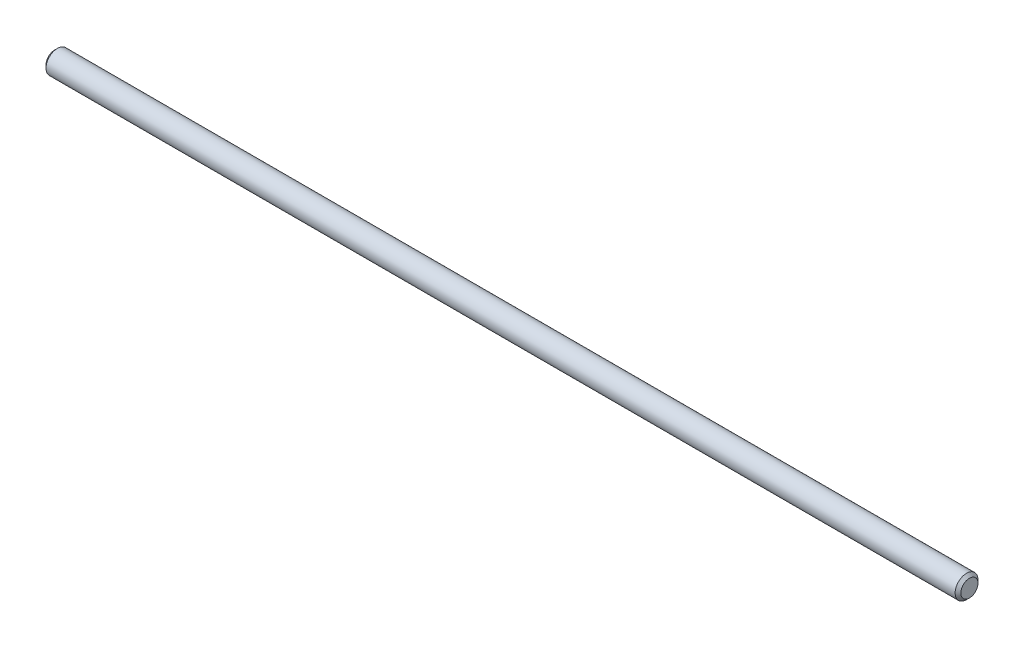
ISO-10303-21;
HEADER;
FILE_DESCRIPTION(('STEP AP214'),'2;1');
FILE_NAME('part.step','',(''),(''),'','','');
FILE_SCHEMA(('AUTOMOTIVE_DESIGN { 1 0 10303 214 1 1 1 1 }'));
ENDSEC;
DATA;
#1=APPLICATION_CONTEXT('core data for automotive mechanical design processes');
#2=APPLICATION_PROTOCOL_DEFINITION('international standard','automotive_design',2000,#1);
#3=PRODUCT_CONTEXT('',#1,'mechanical');
#4=PRODUCT('Part','Part','',(#3));
#5=PRODUCT_RELATED_PRODUCT_CATEGORY('part','',(#4));
#6=PRODUCT_DEFINITION_FORMATION('','',#4);
#7=PRODUCT_DEFINITION_CONTEXT('part definition',#1,'design');
#8=PRODUCT_DEFINITION('design','',#6,#7);
#9=PRODUCT_DEFINITION_SHAPE('','',#8);
#10=(LENGTH_UNIT() NAMED_UNIT(*) SI_UNIT(.MILLI.,.METRE.));
#11=(NAMED_UNIT(*) PLANE_ANGLE_UNIT() SI_UNIT($,.RADIAN.));
#12=(NAMED_UNIT(*) SI_UNIT($,.STERADIAN.) SOLID_ANGLE_UNIT());
#13=UNCERTAINTY_MEASURE_WITH_UNIT(LENGTH_MEASURE(1.E-05),#10,'distance_accuracy_value','');
#14=(GEOMETRIC_REPRESENTATION_CONTEXT(3) GLOBAL_UNCERTAINTY_ASSIGNED_CONTEXT((#13)) GLOBAL_UNIT_ASSIGNED_CONTEXT((#10,
#11,#12)) REPRESENTATION_CONTEXT('',''));
#15=CARTESIAN_POINT('',(0.,0.,0.));
#16=DIRECTION('',(0.,0.,1.));
#17=DIRECTION('',(1.,0.,0.));
#18=AXIS2_PLACEMENT_3D('',#15,#16,#17);
#19=CARTESIAN_POINT('',(80.,0.,0.));
#20=DIRECTION('',(-1.,0.,0.));
#21=DIRECTION('',(0.,0.,1.));
#22=AXIS2_PLACEMENT_3D('',#19,#20,#21);
#23=CYLINDRICAL_SURFACE('',#22,2.);
#24=CARTESIAN_POINT('',(79.5,0.,0.));
#25=DIRECTION('',(1.,0.,0.));
#26=DIRECTION('',(0.,0.,-1.));
#27=AXIS2_PLACEMENT_3D('',#24,#25,#26);
#28=CIRCLE('',#27,2.);
#29=CARTESIAN_POINT('',(79.5,0.,-2.));
#30=VERTEX_POINT('',#29);
#31=EDGE_CURVE('E43',#30,#30,#28,.F.);
#32=ORIENTED_EDGE('',*,*,#31,.T.);
#33=EDGE_LOOP('',(#32));
#34=FACE_BOUND('',#33,.T.);
#35=CARTESIAN_POINT('',(-79.5,0.,0.));
#36=DIRECTION('',(1.,0.,0.));
#37=DIRECTION('',(0.,0.,-1.));
#38=AXIS2_PLACEMENT_3D('',#35,#36,#37);
#39=CIRCLE('',#38,2.);
#40=CARTESIAN_POINT('',(-79.5,0.,-2.));
#41=VERTEX_POINT('',#40);
#42=EDGE_CURVE('E47',#41,#41,#39,.T.);
#43=ORIENTED_EDGE('',*,*,#42,.T.);
#44=EDGE_LOOP('',(#43));
#45=FACE_BOUND('',#44,.T.);
#46=ADVANCED_FACE('F36',(#34,#45),#23,.T.);
#47=CARTESIAN_POINT('',(80.,0.,0.));
#48=DIRECTION('',(1.,0.,0.));
#49=DIRECTION('',(0.,0.,-1.));
#50=AXIS2_PLACEMENT_3D('',#47,#48,#49);
#51=PLANE('',#50);
#52=CARTESIAN_POINT('',(80.,0.,0.));
#53=DIRECTION('',(1.,0.,0.));
#54=DIRECTION('',(0.,0.,-1.));
#55=AXIS2_PLACEMENT_3D('',#52,#53,#54);
#56=CIRCLE('',#55,1.5);
#57=CARTESIAN_POINT('',(80.,0.,-1.5));
#58=VERTEX_POINT('',#57);
#59=EDGE_CURVE('E51',#58,#58,#56,.T.);
#60=ORIENTED_EDGE('',*,*,#59,.T.);
#61=EDGE_LOOP('',(#60));
#62=FACE_BOUND('',#61,.T.);
#63=ADVANCED_FACE('F57',(#62),#51,.T.);
#64=CARTESIAN_POINT('',(-80.,0.,0.));
#65=DIRECTION('',(1.,0.,0.));
#66=DIRECTION('',(0.,0.,-1.));
#67=AXIS2_PLACEMENT_3D('',#64,#65,#66);
#68=PLANE('',#67);
#69=CARTESIAN_POINT('',(-80.,0.,0.));
#70=DIRECTION('',(1.,0.,0.));
#71=DIRECTION('',(0.,0.,-1.));
#72=AXIS2_PLACEMENT_3D('',#69,#70,#71);
#73=CIRCLE('',#72,1.49999999999996);
#74=CARTESIAN_POINT('',(-80.,0.,-1.49999999999996));
#75=VERTEX_POINT('',#74);
#76=EDGE_CURVE('E10',#75,#75,#73,.F.);
#77=ORIENTED_EDGE('',*,*,#76,.T.);
#78=EDGE_LOOP('',(#77));
#79=FACE_BOUND('',#78,.T.);
#80=ADVANCED_FACE('F61',(#79),#68,.F.);
#81=CARTESIAN_POINT('',(80.,0.,0.));
#82=DIRECTION('',(-1.,0.,0.));
#83=DIRECTION('',(0.,0.,1.));
#84=AXIS2_PLACEMENT_3D('',#81,#82,#83);
#85=CONICAL_SURFACE('',#84,1.5,0.785398163397432);
#86=ORIENTED_EDGE('',*,*,#31,.F.);
#87=EDGE_LOOP('',(#86));
#88=FACE_BOUND('',#87,.T.);
#89=ORIENTED_EDGE('',*,*,#59,.F.);
#90=EDGE_LOOP('',(#89));
#91=FACE_BOUND('',#90,.T.);
#92=ADVANCED_FACE('F59',(#88,#91),#85,.T.);
#93=CARTESIAN_POINT('',(-79.5,0.,0.));
#94=DIRECTION('',(1.,0.,0.));
#95=DIRECTION('',(0.,0.,-1.));
#96=AXIS2_PLACEMENT_3D('',#93,#94,#95);
#97=CONICAL_SURFACE('',#96,2.,0.78539816339746);
#98=ORIENTED_EDGE('',*,*,#76,.F.);
#99=EDGE_LOOP('',(#98));
#100=FACE_BOUND('',#99,.T.);
#101=ORIENTED_EDGE('',*,*,#42,.F.);
#102=EDGE_LOOP('',(#101));
#103=FACE_BOUND('',#102,.T.);
#104=ADVANCED_FACE('F38',(#100,#103),#97,.T.);
#105=CLOSED_SHELL('',(#46,#63,#80,#92,#104));
#106=MANIFOLD_SOLID_BREP('B2',#105);
#107=ADVANCED_BREP_SHAPE_REPRESENTATION('',(#18,#106),#14);
#108=SHAPE_DEFINITION_REPRESENTATION(#9,#107);
ENDSEC;
END-ISO-10303-21;
